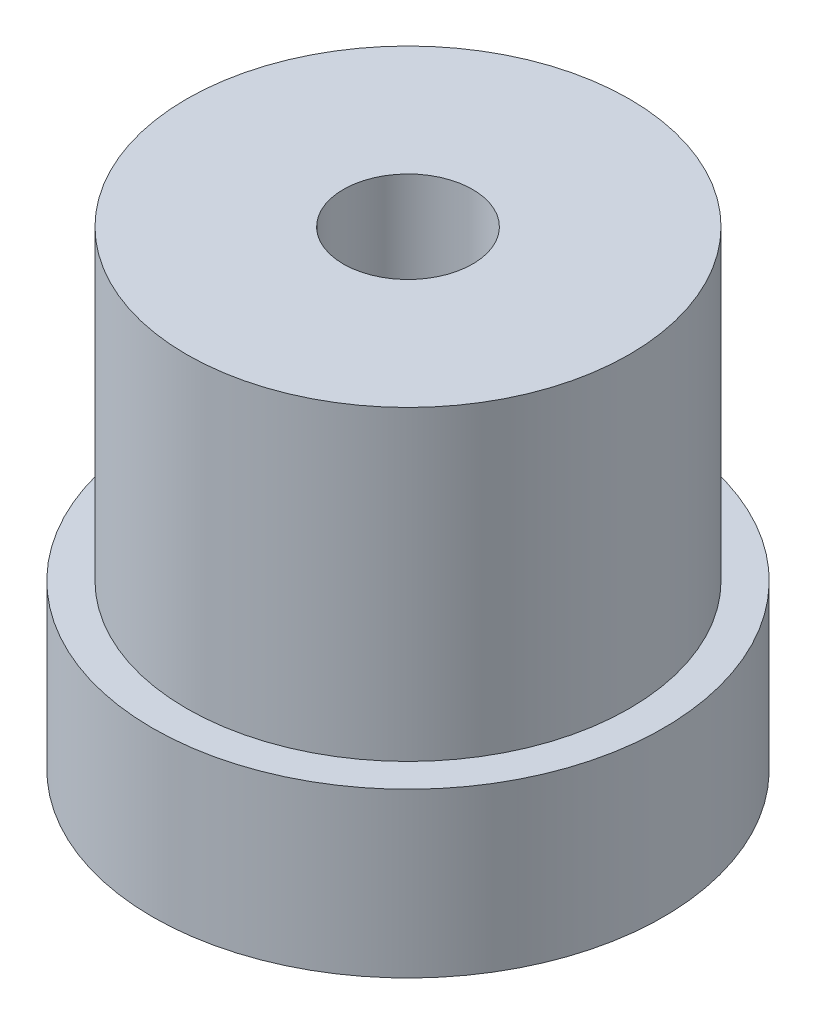
ISO-10303-21;
HEADER;
FILE_DESCRIPTION(('STEP AP214'),'2;1');
FILE_NAME('part.step','',(''),(''),'','','');
FILE_SCHEMA(('AUTOMOTIVE_DESIGN { 1 0 10303 214 1 1 1 1 }'));
ENDSEC;
DATA;
#1=APPLICATION_CONTEXT('core data for automotive mechanical design processes');
#2=APPLICATION_PROTOCOL_DEFINITION('international standard','automotive_design',2000,#1);
#3=PRODUCT_CONTEXT('',#1,'mechanical');
#4=PRODUCT('Part','Part','',(#3));
#5=PRODUCT_RELATED_PRODUCT_CATEGORY('part','',(#4));
#6=PRODUCT_DEFINITION_FORMATION('','',#4);
#7=PRODUCT_DEFINITION_CONTEXT('part definition',#1,'design');
#8=PRODUCT_DEFINITION('design','',#6,#7);
#9=PRODUCT_DEFINITION_SHAPE('','',#8);
#10=(LENGTH_UNIT() NAMED_UNIT(*) SI_UNIT(.MILLI.,.METRE.));
#11=(NAMED_UNIT(*) PLANE_ANGLE_UNIT() SI_UNIT($,.RADIAN.));
#12=(NAMED_UNIT(*) SI_UNIT($,.STERADIAN.) SOLID_ANGLE_UNIT());
#13=UNCERTAINTY_MEASURE_WITH_UNIT(LENGTH_MEASURE(1.E-05),#10,'distance_accuracy_value','');
#14=(GEOMETRIC_REPRESENTATION_CONTEXT(3) GLOBAL_UNCERTAINTY_ASSIGNED_CONTEXT((#13)) GLOBAL_UNIT_ASSIGNED_CONTEXT((#10,
#11,#12)) REPRESENTATION_CONTEXT('',''));
#15=CARTESIAN_POINT('',(0.,0.,0.));
#16=DIRECTION('',(0.,0.,1.));
#17=DIRECTION('',(1.,0.,0.));
#18=AXIS2_PLACEMENT_3D('',#15,#16,#17);
#19=CARTESIAN_POINT('',(0.,13.8025,0.));
#20=DIRECTION('',(0.,1.,0.));
#21=DIRECTION('',(0.,0.,1.));
#22=AXIS2_PLACEMENT_3D('',#19,#20,#21);
#23=PLANE('',#22);
#24=CARTESIAN_POINT('',(0.,13.8025,0.));
#25=DIRECTION('',(0.,1.,0.));
#26=DIRECTION('',(0.,0.,1.));
#27=AXIS2_PLACEMENT_3D('',#24,#25,#26);
#28=CIRCLE('',#27,1.89865);
#29=CARTESIAN_POINT('',(0.,13.8025,1.89865));
#30=VERTEX_POINT('',#29);
#31=EDGE_CURVE('E67',#30,#30,#28,.T.);
#32=ORIENTED_EDGE('',*,*,#31,.F.);
#33=EDGE_LOOP('',(#32));
#34=FACE_BOUND('',#33,.T.);
#35=CARTESIAN_POINT('',(0.,13.8025,0.));
#36=DIRECTION('',(0.,-1.,0.));
#37=DIRECTION('',(0.,0.,-1.));
#38=AXIS2_PLACEMENT_3D('',#35,#36,#37);
#39=CIRCLE('',#38,6.5);
#40=CARTESIAN_POINT('',(0.,13.8025,-6.5));
#41=VERTEX_POINT('',#40);
#42=EDGE_CURVE('E11',#41,#41,#39,.T.);
#43=ORIENTED_EDGE('',*,*,#42,.F.);
#44=EDGE_LOOP('',(#43));
#45=FACE_BOUND('',#44,.T.);
#46=ADVANCED_FACE('F36',(#34,#45),#23,.T.);
#47=CARTESIAN_POINT('',(0.,0.,0.));
#48=DIRECTION('',(0.,-1.,0.));
#49=DIRECTION('',(0.,0.,-1.));
#50=AXIS2_PLACEMENT_3D('',#47,#48,#49);
#51=CYLINDRICAL_SURFACE('',#50,6.5);
#52=ORIENTED_EDGE('',*,*,#42,.T.);
#53=EDGE_LOOP('',(#52));
#54=FACE_BOUND('',#53,.T.);
#55=CARTESIAN_POINT('',(0.,4.8,0.));
#56=DIRECTION('',(0.,-1.,0.));
#57=DIRECTION('',(0.,0.,-1.));
#58=AXIS2_PLACEMENT_3D('',#55,#56,#57);
#59=CIRCLE('',#58,6.5);
#60=CARTESIAN_POINT('',(0.,4.8,-6.5));
#61=VERTEX_POINT('',#60);
#62=EDGE_CURVE('E43',#61,#61,#59,.T.);
#63=ORIENTED_EDGE('',*,*,#62,.F.);
#64=EDGE_LOOP('',(#63));
#65=FACE_BOUND('',#64,.T.);
#66=ADVANCED_FACE('F100',(#54,#65),#51,.T.);
#67=CARTESIAN_POINT('',(6.5,4.8,0.));
#68=DIRECTION('',(0.,1.,0.));
#69=DIRECTION('',(0.,0.,1.));
#70=AXIS2_PLACEMENT_3D('',#67,#68,#69);
#71=PLANE('',#70);
#72=ORIENTED_EDGE('',*,*,#62,.T.);
#73=EDGE_LOOP('',(#72));
#74=FACE_BOUND('',#73,.T.);
#75=CARTESIAN_POINT('',(0.,4.8,0.));
#76=DIRECTION('',(0.,-1.,0.));
#77=DIRECTION('',(0.,0.,-1.));
#78=AXIS2_PLACEMENT_3D('',#75,#76,#77);
#79=CIRCLE('',#78,7.5);
#80=CARTESIAN_POINT('',(0.,4.8,-7.5));
#81=VERTEX_POINT('',#80);
#82=EDGE_CURVE('E92',#81,#81,#79,.T.);
#83=ORIENTED_EDGE('',*,*,#82,.F.);
#84=EDGE_LOOP('',(#83));
#85=FACE_BOUND('',#84,.T.);
#86=ADVANCED_FACE('F97',(#74,#85),#71,.T.);
#87=CARTESIAN_POINT('',(0.,0.,0.));
#88=DIRECTION('',(0.,-1.,0.));
#89=DIRECTION('',(0.,0.,-1.));
#90=AXIS2_PLACEMENT_3D('',#87,#88,#89);
#91=CYLINDRICAL_SURFACE('',#90,7.5);
#92=ORIENTED_EDGE('',*,*,#82,.T.);
#93=EDGE_LOOP('',(#92));
#94=FACE_BOUND('',#93,.T.);
#95=CARTESIAN_POINT('',(0.,0.,0.));
#96=DIRECTION('',(0.,-1.,0.));
#97=DIRECTION('',(0.,0.,-1.));
#98=AXIS2_PLACEMENT_3D('',#95,#96,#97);
#99=CIRCLE('',#98,7.5);
#100=CARTESIAN_POINT('',(0.,0.,-7.5));
#101=VERTEX_POINT('',#100);
#102=EDGE_CURVE('E89',#101,#101,#99,.T.);
#103=ORIENTED_EDGE('',*,*,#102,.F.);
#104=EDGE_LOOP('',(#103));
#105=FACE_BOUND('',#104,.T.);
#106=ADVANCED_FACE('F107',(#94,#105),#91,.T.);
#107=CARTESIAN_POINT('',(7.5,0.,0.));
#108=DIRECTION('',(0.,-1.,0.));
#109=DIRECTION('',(0.,0.,-1.));
#110=AXIS2_PLACEMENT_3D('',#107,#108,#109);
#111=PLANE('',#110);
#112=CARTESIAN_POINT('',(0.,0.,-5.));
#113=DIRECTION('',(0.,-1.,0.));
#114=DIRECTION('',(0.,0.,-1.));
#115=AXIS2_PLACEMENT_3D('',#112,#113,#114);
#116=CIRCLE('',#115,1.24999999999999);
#117=CARTESIAN_POINT('',(0.,0.,-6.24999999999999));
#118=VERTEX_POINT('',#117);
#119=EDGE_CURVE('E66',#118,#118,#116,.T.);
#120=ORIENTED_EDGE('',*,*,#119,.F.);
#121=EDGE_LOOP('',(#120));
#122=FACE_BOUND('',#121,.T.);
#123=CARTESIAN_POINT('',(-4.33012701892309,0.,2.49999999999948));
#124=DIRECTION('',(0.,-1.,0.));
#125=DIRECTION('',(0.,0.,-1.));
#126=AXIS2_PLACEMENT_3D('',#123,#124,#125);
#127=CIRCLE('',#126,1.24999999999999);
#128=CARTESIAN_POINT('',(-4.33012701892309,0.,1.2499999999995));
#129=VERTEX_POINT('',#128);
#130=EDGE_CURVE('E77',#129,#129,#127,.T.);
#131=ORIENTED_EDGE('',*,*,#130,.F.);
#132=EDGE_LOOP('',(#131));
#133=FACE_BOUND('',#132,.T.);
#134=CARTESIAN_POINT('',(4.3301270189213,0.,2.50000000000051));
#135=DIRECTION('',(0.,-1.,0.));
#136=DIRECTION('',(0.,0.,-1.));
#137=AXIS2_PLACEMENT_3D('',#134,#135,#136);
#138=CIRCLE('',#137,1.24999999999999);
#139=CARTESIAN_POINT('',(4.3301270189213,0.,1.25000000000052));
#140=VERTEX_POINT('',#139);
#141=EDGE_CURVE('E83',#140,#140,#138,.T.);
#142=ORIENTED_EDGE('',*,*,#141,.F.);
#143=EDGE_LOOP('',(#142));
#144=FACE_BOUND('',#143,.T.);
#145=ORIENTED_EDGE('',*,*,#102,.T.);
#146=EDGE_LOOP('',(#145));
#147=FACE_BOUND('',#146,.T.);
#148=ADVANCED_FACE('F113',(#122,#133,#144,#147),#111,.T.);
#149=CARTESIAN_POINT('',(4.3301270189213,7.5,2.50000000000051));
#150=DIRECTION('',(0.,-1.,0.));
#151=DIRECTION('',(0.,0.,-1.));
#152=AXIS2_PLACEMENT_3D('',#149,#150,#151);
#153=CONICAL_SURFACE('',#152,1.25,1.02974425867665);
#154=CARTESIAN_POINT('',(4.3301270189213,8.25107577378445,2.50000000000051));
#155=VERTEX_POINT('',#154);
#156=VERTEX_LOOP('',#155);
#157=FACE_BOUND('',#156,.T.);
#158=CARTESIAN_POINT('',(4.3301270189213,7.5,2.50000000000051));
#159=DIRECTION('',(0.,-1.,0.));
#160=DIRECTION('',(0.,0.,-1.));
#161=AXIS2_PLACEMENT_3D('',#158,#159,#160);
#162=CIRCLE('',#161,1.25);
#163=CARTESIAN_POINT('',(4.3301270189213,7.5,1.25000000000052));
#164=VERTEX_POINT('',#163);
#165=EDGE_CURVE('E86',#164,#164,#162,.T.);
#166=ORIENTED_EDGE('',*,*,#165,.T.);
#167=EDGE_LOOP('',(#166));
#168=FACE_BOUND('',#167,.T.);
#169=ADVANCED_FACE('F117',(#157,#168),#153,.F.);
#170=CARTESIAN_POINT('',(4.3301270189213,0.,2.50000000000051));
#171=DIRECTION('',(0.,-1.,0.));
#172=DIRECTION('',(0.,0.,-1.));
#173=AXIS2_PLACEMENT_3D('',#170,#171,#172);
#174=CYLINDRICAL_SURFACE('',#173,1.24999999999999);
#175=ORIENTED_EDGE('',*,*,#165,.F.);
#176=EDGE_LOOP('',(#175));
#177=FACE_BOUND('',#176,.T.);
#178=ORIENTED_EDGE('',*,*,#141,.T.);
#179=EDGE_LOOP('',(#178));
#180=FACE_BOUND('',#179,.T.);
#181=ADVANCED_FACE('F121',(#177,#180),#174,.F.);
#182=CARTESIAN_POINT('',(-4.33012701892309,7.5,2.49999999999948));
#183=DIRECTION('',(0.,-1.,0.));
#184=DIRECTION('',(0.,0.,-1.));
#185=AXIS2_PLACEMENT_3D('',#182,#183,#184);
#186=CONICAL_SURFACE('',#185,1.25,1.02974425867665);
#187=CARTESIAN_POINT('',(-4.33012701892309,8.25107577378445,2.49999999999948));
#188=VERTEX_POINT('',#187);
#189=VERTEX_LOOP('',#188);
#190=FACE_BOUND('',#189,.T.);
#191=CARTESIAN_POINT('',(-4.33012701892309,7.5,2.49999999999948));
#192=DIRECTION('',(0.,-1.,0.));
#193=DIRECTION('',(0.,0.,-1.));
#194=AXIS2_PLACEMENT_3D('',#191,#192,#193);
#195=CIRCLE('',#194,1.25);
#196=CARTESIAN_POINT('',(-4.33012701892309,7.5,1.24999999999949));
#197=VERTEX_POINT('',#196);
#198=EDGE_CURVE('E80',#197,#197,#195,.T.);
#199=ORIENTED_EDGE('',*,*,#198,.T.);
#200=EDGE_LOOP('',(#199));
#201=FACE_BOUND('',#200,.T.);
#202=ADVANCED_FACE('F124',(#190,#201),#186,.F.);
#203=CARTESIAN_POINT('',(-4.33012701892309,0.,2.49999999999948));
#204=DIRECTION('',(0.,-1.,0.));
#205=DIRECTION('',(0.,0.,-1.));
#206=AXIS2_PLACEMENT_3D('',#203,#204,#205);
#207=CYLINDRICAL_SURFACE('',#206,1.24999999999999);
#208=ORIENTED_EDGE('',*,*,#198,.F.);
#209=EDGE_LOOP('',(#208));
#210=FACE_BOUND('',#209,.T.);
#211=ORIENTED_EDGE('',*,*,#130,.T.);
#212=EDGE_LOOP('',(#211));
#213=FACE_BOUND('',#212,.T.);
#214=ADVANCED_FACE('F128',(#210,#213),#207,.F.);
#215=CARTESIAN_POINT('',(0.,7.5,-5.));
#216=DIRECTION('',(0.,-1.,0.));
#217=DIRECTION('',(0.,0.,-1.));
#218=AXIS2_PLACEMENT_3D('',#215,#216,#217);
#219=CONICAL_SURFACE('',#218,1.25,1.02974425867665);
#220=CARTESIAN_POINT('',(0.,8.25107577378445,-5.));
#221=VERTEX_POINT('',#220);
#222=VERTEX_LOOP('',#221);
#223=FACE_BOUND('',#222,.T.);
#224=CARTESIAN_POINT('',(0.,7.5,-5.));
#225=DIRECTION('',(0.,-1.,0.));
#226=DIRECTION('',(0.,0.,-1.));
#227=AXIS2_PLACEMENT_3D('',#224,#225,#226);
#228=CIRCLE('',#227,1.25);
#229=CARTESIAN_POINT('',(0.,7.5,-6.25));
#230=VERTEX_POINT('',#229);
#231=EDGE_CURVE('E70',#230,#230,#228,.T.);
#232=ORIENTED_EDGE('',*,*,#231,.T.);
#233=EDGE_LOOP('',(#232));
#234=FACE_BOUND('',#233,.T.);
#235=ADVANCED_FACE('F131',(#223,#234),#219,.F.);
#236=CARTESIAN_POINT('',(0.,0.,-5.));
#237=DIRECTION('',(0.,-1.,0.));
#238=DIRECTION('',(0.,0.,-1.));
#239=AXIS2_PLACEMENT_3D('',#236,#237,#238);
#240=CYLINDRICAL_SURFACE('',#239,1.24999999999999);
#241=ORIENTED_EDGE('',*,*,#231,.F.);
#242=EDGE_LOOP('',(#241));
#243=FACE_BOUND('',#242,.T.);
#244=ORIENTED_EDGE('',*,*,#119,.T.);
#245=EDGE_LOOP('',(#244));
#246=FACE_BOUND('',#245,.T.);
#247=ADVANCED_FACE('F60',(#243,#246),#240,.F.);
#248=CARTESIAN_POINT('',(0.,3.8025,0.));
#249=DIRECTION('',(0.,1.,0.));
#250=DIRECTION('',(0.,0.,1.));
#251=AXIS2_PLACEMENT_3D('',#248,#249,#250);
#252=CONICAL_SURFACE('',#251,1.89865,1.02974425867665);
#253=CARTESIAN_POINT('',(0.,2.66167598568332,0.));
#254=VERTEX_POINT('',#253);
#255=VERTEX_LOOP('',#254);
#256=FACE_BOUND('',#255,.T.);
#257=CARTESIAN_POINT('',(0.,3.8025,0.));
#258=DIRECTION('',(0.,1.,0.));
#259=DIRECTION('',(0.,0.,1.));
#260=AXIS2_PLACEMENT_3D('',#257,#258,#259);
#261=CIRCLE('',#260,1.89865);
#262=CARTESIAN_POINT('',(0.,3.8025,1.89865));
#263=VERTEX_POINT('',#262);
#264=EDGE_CURVE('E64',#263,#263,#261,.T.);
#265=ORIENTED_EDGE('',*,*,#264,.T.);
#266=EDGE_LOOP('',(#265));
#267=FACE_BOUND('',#266,.T.);
#268=ADVANCED_FACE('F56',(#256,#267),#252,.F.);
#269=CARTESIAN_POINT('',(0.,13.8025,0.));
#270=DIRECTION('',(0.,1.,0.));
#271=DIRECTION('',(0.,0.,1.));
#272=AXIS2_PLACEMENT_3D('',#269,#270,#271);
#273=CYLINDRICAL_SURFACE('',#272,1.89865);
#274=ORIENTED_EDGE('',*,*,#264,.F.);
#275=EDGE_LOOP('',(#274));
#276=FACE_BOUND('',#275,.T.);
#277=ORIENTED_EDGE('',*,*,#31,.T.);
#278=EDGE_LOOP('',(#277));
#279=FACE_BOUND('',#278,.T.);
#280=ADVANCED_FACE('F59',(#276,#279),#273,.F.);
#281=CLOSED_SHELL('',(#46,#66,#86,#106,#148,#169,#181,#202,#214,#235,#247,#268,#280));
#282=MANIFOLD_SOLID_BREP('B2',#281);
#283=ADVANCED_BREP_SHAPE_REPRESENTATION('',(#18,#282),#14);
#284=SHAPE_DEFINITION_REPRESENTATION(#9,#283);
ENDSEC;
END-ISO-10303-21;
